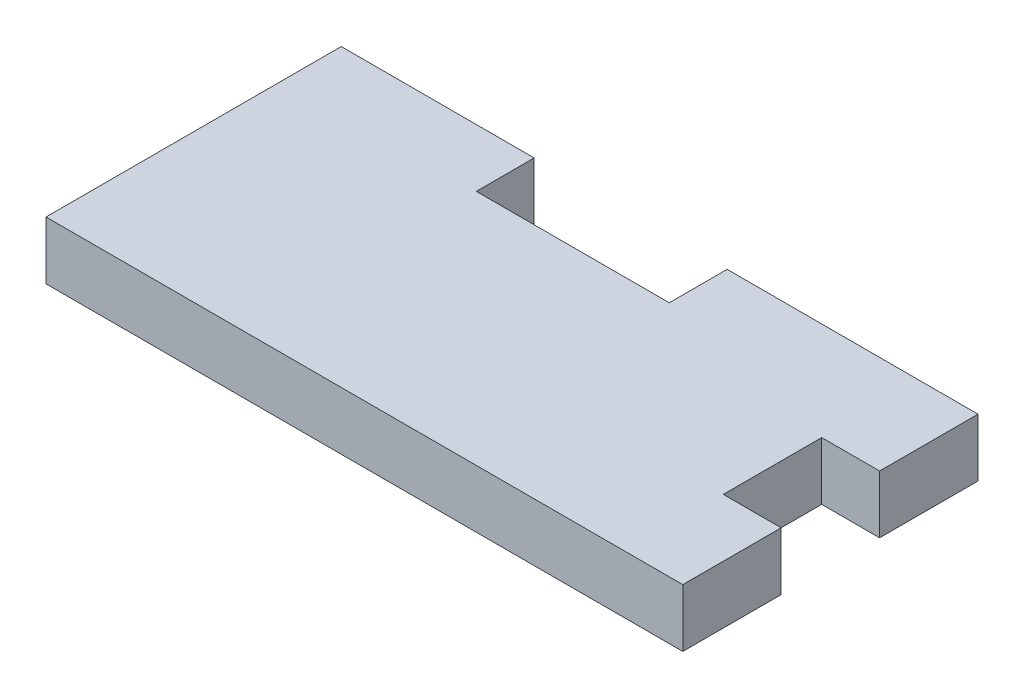
ISO-10303-21;
HEADER;
FILE_DESCRIPTION(('STEP AP214'),'2;1');
FILE_NAME('part.step','',(''),(''),'','','');
FILE_SCHEMA(('AUTOMOTIVE_DESIGN { 1 0 10303 214 1 1 1 1 }'));
ENDSEC;
DATA;
#1=APPLICATION_CONTEXT('core data for automotive mechanical design processes');
#2=APPLICATION_PROTOCOL_DEFINITION('international standard','automotive_design',2000,#1);
#3=PRODUCT_CONTEXT('',#1,'mechanical');
#4=PRODUCT('Part','Part','',(#3));
#5=PRODUCT_RELATED_PRODUCT_CATEGORY('part','',(#4));
#6=PRODUCT_DEFINITION_FORMATION('','',#4);
#7=PRODUCT_DEFINITION_CONTEXT('part definition',#1,'design');
#8=PRODUCT_DEFINITION('design','',#6,#7);
#9=PRODUCT_DEFINITION_SHAPE('','',#8);
#10=(LENGTH_UNIT() NAMED_UNIT(*) SI_UNIT(.MILLI.,.METRE.));
#11=(NAMED_UNIT(*) PLANE_ANGLE_UNIT() SI_UNIT($,.RADIAN.));
#12=(NAMED_UNIT(*) SI_UNIT($,.STERADIAN.) SOLID_ANGLE_UNIT());
#13=UNCERTAINTY_MEASURE_WITH_UNIT(LENGTH_MEASURE(1.E-05),#10,'distance_accuracy_value','');
#14=(GEOMETRIC_REPRESENTATION_CONTEXT(3) GLOBAL_UNCERTAINTY_ASSIGNED_CONTEXT((#13)) GLOBAL_UNIT_ASSIGNED_CONTEXT((#10,
#11,#12)) REPRESENTATION_CONTEXT('',''));
#15=CARTESIAN_POINT('',(0.,0.,0.));
#16=DIRECTION('',(0.,0.,1.));
#17=DIRECTION('',(1.,0.,0.));
#18=AXIS2_PLACEMENT_3D('',#15,#16,#17);
#19=CARTESIAN_POINT('',(0.,3.,0.));
#20=DIRECTION('',(1.,0.,0.));
#21=DIRECTION('',(0.,0.,-1.));
#22=AXIS2_PLACEMENT_3D('',#19,#20,#21);
#23=PLANE('',#22);
#24=DIRECTION('',(0.,0.,1.));
#25=VECTOR('',#24,1.);
#26=CARTESIAN_POINT('',(0.,0.,0.));
#27=LINE('',#26,#25);
#28=CARTESIAN_POINT('',(0.,0.,-15.3));
#29=VERTEX_POINT('',#28);
#30=CARTESIAN_POINT('',(0.,0.,0.));
#31=VERTEX_POINT('',#30);
#32=EDGE_CURVE('E160',#29,#31,#27,.T.);
#33=ORIENTED_EDGE('',*,*,#32,.T.);
#34=DIRECTION('',(0.,-1.,0.));
#35=VECTOR('',#34,1.);
#36=CARTESIAN_POINT('',(0.,3.,0.));
#37=LINE('',#36,#35);
#38=CARTESIAN_POINT('',(0.,3.,0.));
#39=VERTEX_POINT('',#38);
#40=EDGE_CURVE('E11',#39,#31,#37,.T.);
#41=ORIENTED_EDGE('',*,*,#40,.F.);
#42=DIRECTION('',(0.,0.,1.));
#43=VECTOR('',#42,1.);
#44=CARTESIAN_POINT('',(0.,3.,0.));
#45=LINE('',#44,#43);
#46=CARTESIAN_POINT('',(0.,3.,-15.3));
#47=VERTEX_POINT('',#46);
#48=EDGE_CURVE('E183',#47,#39,#45,.T.);
#49=ORIENTED_EDGE('',*,*,#48,.F.);
#50=DIRECTION('',(0.,-1.,0.));
#51=VECTOR('',#50,1.);
#52=CARTESIAN_POINT('',(0.,3.,-15.3));
#53=LINE('',#52,#51);
#54=EDGE_CURVE('E156',#47,#29,#53,.T.);
#55=ORIENTED_EDGE('',*,*,#54,.T.);
#56=EDGE_LOOP('',(#33,#41,#49,#55));
#57=FACE_BOUND('',#56,.T.);
#58=ADVANCED_FACE('F40',(#57),#23,.F.);
#59=CARTESIAN_POINT('',(33.,3.,0.));
#60=DIRECTION('',(0.,0.,-1.));
#61=DIRECTION('',(-1.,0.,0.));
#62=AXIS2_PLACEMENT_3D('',#59,#60,#61);
#63=PLANE('',#62);
#64=DIRECTION('',(1.,0.,0.));
#65=VECTOR('',#64,1.);
#66=CARTESIAN_POINT('',(33.,0.,0.));
#67=LINE('',#66,#65);
#68=CARTESIAN_POINT('',(33.,0.,0.));
#69=VERTEX_POINT('',#68);
#70=EDGE_CURVE('E163',#31,#69,#67,.T.);
#71=ORIENTED_EDGE('',*,*,#70,.T.);
#72=DIRECTION('',(0.,-1.,0.));
#73=VECTOR('',#72,1.);
#74=CARTESIAN_POINT('',(33.,3.,0.));
#75=LINE('',#74,#73);
#76=CARTESIAN_POINT('',(33.,3.,0.));
#77=VERTEX_POINT('',#76);
#78=EDGE_CURVE('E48',#77,#69,#75,.T.);
#79=ORIENTED_EDGE('',*,*,#78,.F.);
#80=DIRECTION('',(1.,0.,0.));
#81=VECTOR('',#80,1.);
#82=CARTESIAN_POINT('',(0.,3.,0.));
#83=LINE('',#82,#81);
#84=EDGE_CURVE('E111',#39,#77,#83,.T.);
#85=ORIENTED_EDGE('',*,*,#84,.F.);
#86=ORIENTED_EDGE('',*,*,#40,.T.);
#87=EDGE_LOOP('',(#71,#79,#85,#86));
#88=FACE_BOUND('',#87,.T.);
#89=ADVANCED_FACE('F260',(#88),#63,.F.);
#90=CARTESIAN_POINT('',(33.,3.,-5.1));
#91=DIRECTION('',(-1.,0.,0.));
#92=DIRECTION('',(0.,0.,1.));
#93=AXIS2_PLACEMENT_3D('',#90,#91,#92);
#94=PLANE('',#93);
#95=DIRECTION('',(0.,0.,-1.));
#96=VECTOR('',#95,1.);
#97=CARTESIAN_POINT('',(33.,0.,-5.1));
#98=LINE('',#97,#96);
#99=CARTESIAN_POINT('',(33.,0.,-5.1));
#100=VERTEX_POINT('',#99);
#101=EDGE_CURVE('E165',#69,#100,#98,.T.);
#102=ORIENTED_EDGE('',*,*,#101,.T.);
#103=DIRECTION('',(0.,-1.,0.));
#104=VECTOR('',#103,1.);
#105=CARTESIAN_POINT('',(33.,3.,-5.1));
#106=LINE('',#105,#104);
#107=CARTESIAN_POINT('',(33.,3.,-5.1));
#108=VERTEX_POINT('',#107);
#109=EDGE_CURVE('E202',#108,#100,#106,.T.);
#110=ORIENTED_EDGE('',*,*,#109,.F.);
#111=DIRECTION('',(0.,0.,-1.));
#112=VECTOR('',#111,1.);
#113=CARTESIAN_POINT('',(33.,3.,-5.1));
#114=LINE('',#113,#112);
#115=EDGE_CURVE('E210',#77,#108,#114,.T.);
#116=ORIENTED_EDGE('',*,*,#115,.F.);
#117=ORIENTED_EDGE('',*,*,#78,.T.);
#118=EDGE_LOOP('',(#102,#110,#116,#117));
#119=FACE_BOUND('',#118,.T.);
#120=ADVANCED_FACE('F208',(#119),#94,.F.);
#121=CARTESIAN_POINT('',(30.,3.,-5.1));
#122=DIRECTION('',(0.,0.,1.));
#123=DIRECTION('',(1.,0.,0.));
#124=AXIS2_PLACEMENT_3D('',#121,#122,#123);
#125=PLANE('',#124);
#126=DIRECTION('',(-1.,0.,0.));
#127=VECTOR('',#126,1.);
#128=CARTESIAN_POINT('',(30.,0.,-5.1));
#129=LINE('',#128,#127);
#130=CARTESIAN_POINT('',(30.,0.,-5.1));
#131=VERTEX_POINT('',#130);
#132=EDGE_CURVE('E167',#100,#131,#129,.T.);
#133=ORIENTED_EDGE('',*,*,#132,.T.);
#134=DIRECTION('',(0.,-1.,0.));
#135=VECTOR('',#134,1.);
#136=CARTESIAN_POINT('',(30.,3.,-5.1));
#137=LINE('',#136,#135);
#138=CARTESIAN_POINT('',(30.,3.,-5.1));
#139=VERTEX_POINT('',#138);
#140=EDGE_CURVE('E199',#139,#131,#137,.T.);
#141=ORIENTED_EDGE('',*,*,#140,.F.);
#142=DIRECTION('',(-1.,0.,0.));
#143=VECTOR('',#142,1.);
#144=CARTESIAN_POINT('',(30.,3.,-5.1));
#145=LINE('',#144,#143);
#146=EDGE_CURVE('E228',#108,#139,#145,.T.);
#147=ORIENTED_EDGE('',*,*,#146,.F.);
#148=ORIENTED_EDGE('',*,*,#109,.T.);
#149=EDGE_LOOP('',(#133,#141,#147,#148));
#150=FACE_BOUND('',#149,.T.);
#151=ADVANCED_FACE('F219',(#150),#125,.F.);
#152=CARTESIAN_POINT('',(30.,3.,-10.2));
#153=DIRECTION('',(-1.,0.,0.));
#154=DIRECTION('',(0.,0.,1.));
#155=AXIS2_PLACEMENT_3D('',#152,#153,#154);
#156=PLANE('',#155);
#157=DIRECTION('',(0.,0.,-1.));
#158=VECTOR('',#157,1.);
#159=CARTESIAN_POINT('',(30.,0.,-10.2));
#160=LINE('',#159,#158);
#161=CARTESIAN_POINT('',(30.,0.,-10.2));
#162=VERTEX_POINT('',#161);
#163=EDGE_CURVE('E169',#131,#162,#160,.T.);
#164=ORIENTED_EDGE('',*,*,#163,.T.);
#165=DIRECTION('',(0.,-1.,0.));
#166=VECTOR('',#165,1.);
#167=CARTESIAN_POINT('',(30.,3.,-10.2));
#168=LINE('',#167,#166);
#169=CARTESIAN_POINT('',(30.,3.,-10.2));
#170=VERTEX_POINT('',#169);
#171=EDGE_CURVE('E196',#170,#162,#168,.T.);
#172=ORIENTED_EDGE('',*,*,#171,.F.);
#173=DIRECTION('',(0.,0.,-1.));
#174=VECTOR('',#173,1.);
#175=CARTESIAN_POINT('',(30.,3.,-10.2));
#176=LINE('',#175,#174);
#177=EDGE_CURVE('E225',#139,#170,#176,.T.);
#178=ORIENTED_EDGE('',*,*,#177,.F.);
#179=ORIENTED_EDGE('',*,*,#140,.T.);
#180=EDGE_LOOP('',(#164,#172,#178,#179));
#181=FACE_BOUND('',#180,.T.);
#182=ADVANCED_FACE('F223',(#181),#156,.F.);
#183=CARTESIAN_POINT('',(33.,3.,-10.2));
#184=DIRECTION('',(0.,0.,-1.));
#185=DIRECTION('',(-1.,0.,0.));
#186=AXIS2_PLACEMENT_3D('',#183,#184,#185);
#187=PLANE('',#186);
#188=DIRECTION('',(1.,0.,0.));
#189=VECTOR('',#188,1.);
#190=CARTESIAN_POINT('',(33.,0.,-10.2));
#191=LINE('',#190,#189);
#192=CARTESIAN_POINT('',(33.,0.,-10.2));
#193=VERTEX_POINT('',#192);
#194=EDGE_CURVE('E171',#162,#193,#191,.T.);
#195=ORIENTED_EDGE('',*,*,#194,.T.);
#196=DIRECTION('',(0.,-1.,0.));
#197=VECTOR('',#196,1.);
#198=CARTESIAN_POINT('',(33.,3.,-10.2));
#199=LINE('',#198,#197);
#200=CARTESIAN_POINT('',(33.,3.,-10.2));
#201=VERTEX_POINT('',#200);
#202=EDGE_CURVE('E193',#201,#193,#199,.T.);
#203=ORIENTED_EDGE('',*,*,#202,.F.);
#204=DIRECTION('',(1.,0.,0.));
#205=VECTOR('',#204,1.);
#206=CARTESIAN_POINT('',(33.,3.,-10.2));
#207=LINE('',#206,#205);
#208=EDGE_CURVE('E227',#170,#201,#207,.T.);
#209=ORIENTED_EDGE('',*,*,#208,.F.);
#210=ORIENTED_EDGE('',*,*,#171,.T.);
#211=EDGE_LOOP('',(#195,#203,#209,#210));
#212=FACE_BOUND('',#211,.T.);
#213=ADVANCED_FACE('F273',(#212),#187,.F.);
#214=CARTESIAN_POINT('',(33.,3.,-15.3));
#215=DIRECTION('',(-1.,0.,0.));
#216=DIRECTION('',(0.,0.,1.));
#217=AXIS2_PLACEMENT_3D('',#214,#215,#216);
#218=PLANE('',#217);
#219=DIRECTION('',(0.,0.,-1.));
#220=VECTOR('',#219,1.);
#221=CARTESIAN_POINT('',(33.,0.,-15.3));
#222=LINE('',#221,#220);
#223=CARTESIAN_POINT('',(33.,0.,-15.3));
#224=VERTEX_POINT('',#223);
#225=EDGE_CURVE('E173',#193,#224,#222,.T.);
#226=ORIENTED_EDGE('',*,*,#225,.T.);
#227=DIRECTION('',(0.,-1.,0.));
#228=VECTOR('',#227,1.);
#229=CARTESIAN_POINT('',(33.,3.,-15.3));
#230=LINE('',#229,#228);
#231=CARTESIAN_POINT('',(33.,3.,-15.3));
#232=VERTEX_POINT('',#231);
#233=EDGE_CURVE('E190',#232,#224,#230,.T.);
#234=ORIENTED_EDGE('',*,*,#233,.F.);
#235=DIRECTION('',(0.,0.,-1.));
#236=VECTOR('',#235,1.);
#237=CARTESIAN_POINT('',(33.,3.,-15.3));
#238=LINE('',#237,#236);
#239=EDGE_CURVE('E230',#201,#232,#238,.T.);
#240=ORIENTED_EDGE('',*,*,#239,.F.);
#241=ORIENTED_EDGE('',*,*,#202,.T.);
#242=EDGE_LOOP('',(#226,#234,#240,#241));
#243=FACE_BOUND('',#242,.T.);
#244=ADVANCED_FACE('F276',(#243),#218,.F.);
#245=CARTESIAN_POINT('',(20.,3.,-15.3));
#246=DIRECTION('',(0.,0.,1.));
#247=DIRECTION('',(1.,0.,0.));
#248=AXIS2_PLACEMENT_3D('',#245,#246,#247);
#249=PLANE('',#248);
#250=DIRECTION('',(-1.,0.,0.));
#251=VECTOR('',#250,1.);
#252=CARTESIAN_POINT('',(20.,0.,-15.3));
#253=LINE('',#252,#251);
#254=CARTESIAN_POINT('',(20.,0.,-15.3));
#255=VERTEX_POINT('',#254);
#256=EDGE_CURVE('E176',#224,#255,#253,.T.);
#257=ORIENTED_EDGE('',*,*,#256,.T.);
#258=DIRECTION('',(0.,-1.,0.));
#259=VECTOR('',#258,1.);
#260=CARTESIAN_POINT('',(20.,3.,-15.3));
#261=LINE('',#260,#259);
#262=CARTESIAN_POINT('',(20.,3.,-15.3));
#263=VERTEX_POINT('',#262);
#264=EDGE_CURVE('E187',#263,#255,#261,.T.);
#265=ORIENTED_EDGE('',*,*,#264,.F.);
#266=DIRECTION('',(-1.,0.,0.));
#267=VECTOR('',#266,1.);
#268=CARTESIAN_POINT('',(30.,3.,-15.3));
#269=LINE('',#268,#267);
#270=EDGE_CURVE('E236',#232,#263,#269,.T.);
#271=ORIENTED_EDGE('',*,*,#270,.F.);
#272=ORIENTED_EDGE('',*,*,#233,.T.);
#273=EDGE_LOOP('',(#257,#265,#271,#272));
#274=FACE_BOUND('',#273,.T.);
#275=ADVANCED_FACE('F242',(#274),#249,.F.);
#276=CARTESIAN_POINT('',(20.,3.,-12.3));
#277=DIRECTION('',(1.,0.,0.));
#278=DIRECTION('',(0.,0.,-1.));
#279=AXIS2_PLACEMENT_3D('',#276,#277,#278);
#280=PLANE('',#279);
#281=DIRECTION('',(0.,0.,1.));
#282=VECTOR('',#281,1.);
#283=CARTESIAN_POINT('',(20.,0.,-12.3));
#284=LINE('',#283,#282);
#285=CARTESIAN_POINT('',(20.,0.,-12.3));
#286=VERTEX_POINT('',#285);
#287=EDGE_CURVE('E178',#255,#286,#284,.T.);
#288=ORIENTED_EDGE('',*,*,#287,.T.);
#289=DIRECTION('',(0.,-1.,0.));
#290=VECTOR('',#289,1.);
#291=CARTESIAN_POINT('',(20.,3.,-12.3));
#292=LINE('',#291,#290);
#293=CARTESIAN_POINT('',(20.,3.,-12.3));
#294=VERTEX_POINT('',#293);
#295=EDGE_CURVE('E151',#294,#286,#292,.T.);
#296=ORIENTED_EDGE('',*,*,#295,.F.);
#297=DIRECTION('',(0.,0.,1.));
#298=VECTOR('',#297,1.);
#299=CARTESIAN_POINT('',(20.,3.,-12.3));
#300=LINE('',#299,#298);
#301=EDGE_CURVE('E142',#263,#294,#300,.T.);
#302=ORIENTED_EDGE('',*,*,#301,.F.);
#303=ORIENTED_EDGE('',*,*,#264,.T.);
#304=EDGE_LOOP('',(#288,#296,#302,#303));
#305=FACE_BOUND('',#304,.T.);
#306=ADVANCED_FACE('F245',(#305),#280,.F.);
#307=CARTESIAN_POINT('',(10.,3.,-12.3));
#308=DIRECTION('',(0.,0.,1.));
#309=DIRECTION('',(1.,0.,0.));
#310=AXIS2_PLACEMENT_3D('',#307,#308,#309);
#311=PLANE('',#310);
#312=DIRECTION('',(-1.,0.,0.));
#313=VECTOR('',#312,1.);
#314=CARTESIAN_POINT('',(10.,0.,-12.3));
#315=LINE('',#314,#313);
#316=CARTESIAN_POINT('',(10.,0.,-12.3));
#317=VERTEX_POINT('',#316);
#318=EDGE_CURVE('E150',#286,#317,#315,.T.);
#319=ORIENTED_EDGE('',*,*,#318,.T.);
#320=DIRECTION('',(0.,-1.,0.));
#321=VECTOR('',#320,1.);
#322=CARTESIAN_POINT('',(10.,3.,-12.3));
#323=LINE('',#322,#321);
#324=CARTESIAN_POINT('',(10.,3.,-12.3));
#325=VERTEX_POINT('',#324);
#326=EDGE_CURVE('E147',#325,#317,#323,.T.);
#327=ORIENTED_EDGE('',*,*,#326,.F.);
#328=DIRECTION('',(-1.,0.,0.));
#329=VECTOR('',#328,1.);
#330=CARTESIAN_POINT('',(10.,3.,-12.3));
#331=LINE('',#330,#329);
#332=EDGE_CURVE('E136',#294,#325,#331,.T.);
#333=ORIENTED_EDGE('',*,*,#332,.F.);
#334=ORIENTED_EDGE('',*,*,#295,.T.);
#335=EDGE_LOOP('',(#319,#327,#333,#334));
#336=FACE_BOUND('',#335,.T.);
#337=ADVANCED_FACE('F148',(#336),#311,.F.);
#338=CARTESIAN_POINT('',(10.,3.,-15.3));
#339=DIRECTION('',(-1.,0.,0.));
#340=DIRECTION('',(0.,0.,1.));
#341=AXIS2_PLACEMENT_3D('',#338,#339,#340);
#342=PLANE('',#341);
#343=DIRECTION('',(0.,0.,-1.));
#344=VECTOR('',#343,1.);
#345=CARTESIAN_POINT('',(10.,0.,-15.3));
#346=LINE('',#345,#344);
#347=CARTESIAN_POINT('',(10.,0.,-15.3));
#348=VERTEX_POINT('',#347);
#349=EDGE_CURVE('E97',#317,#348,#346,.T.);
#350=ORIENTED_EDGE('',*,*,#349,.T.);
#351=DIRECTION('',(0.,-1.,0.));
#352=VECTOR('',#351,1.);
#353=CARTESIAN_POINT('',(10.,3.,-15.3));
#354=LINE('',#353,#352);
#355=CARTESIAN_POINT('',(10.,3.,-15.3));
#356=VERTEX_POINT('',#355);
#357=EDGE_CURVE('E152',#356,#348,#354,.T.);
#358=ORIENTED_EDGE('',*,*,#357,.F.);
#359=DIRECTION('',(0.,0.,-1.));
#360=VECTOR('',#359,1.);
#361=CARTESIAN_POINT('',(10.,3.,-15.3));
#362=LINE('',#361,#360);
#363=EDGE_CURVE('E140',#325,#356,#362,.T.);
#364=ORIENTED_EDGE('',*,*,#363,.F.);
#365=ORIENTED_EDGE('',*,*,#326,.T.);
#366=EDGE_LOOP('',(#350,#358,#364,#365));
#367=FACE_BOUND('',#366,.T.);
#368=ADVANCED_FACE('F154',(#367),#342,.F.);
#369=CARTESIAN_POINT('',(0.,3.,-15.3));
#370=DIRECTION('',(0.,0.,1.));
#371=DIRECTION('',(1.,0.,0.));
#372=AXIS2_PLACEMENT_3D('',#369,#370,#371);
#373=PLANE('',#372);
#374=DIRECTION('',(-1.,0.,0.));
#375=VECTOR('',#374,1.);
#376=CARTESIAN_POINT('',(0.,0.,-15.3));
#377=LINE('',#376,#375);
#378=EDGE_CURVE('E103',#348,#29,#377,.T.);
#379=ORIENTED_EDGE('',*,*,#378,.T.);
#380=ORIENTED_EDGE('',*,*,#54,.F.);
#381=DIRECTION('',(-1.,0.,0.));
#382=VECTOR('',#381,1.);
#383=CARTESIAN_POINT('',(0.,3.,-15.3));
#384=LINE('',#383,#382);
#385=EDGE_CURVE('E56',#356,#47,#384,.T.);
#386=ORIENTED_EDGE('',*,*,#385,.F.);
#387=ORIENTED_EDGE('',*,*,#357,.T.);
#388=EDGE_LOOP('',(#379,#380,#386,#387));
#389=FACE_BOUND('',#388,.T.);
#390=ADVANCED_FACE('F249',(#389),#373,.F.);
#391=CARTESIAN_POINT('',(0.,3.,0.));
#392=DIRECTION('',(0.,-1.,0.));
#393=DIRECTION('',(0.,0.,-1.));
#394=AXIS2_PLACEMENT_3D('',#391,#392,#393);
#395=PLANE('',#394);
#396=ORIENTED_EDGE('',*,*,#48,.T.);
#397=ORIENTED_EDGE('',*,*,#84,.T.);
#398=ORIENTED_EDGE('',*,*,#115,.T.);
#399=ORIENTED_EDGE('',*,*,#146,.T.);
#400=ORIENTED_EDGE('',*,*,#177,.T.);
#401=ORIENTED_EDGE('',*,*,#208,.T.);
#402=ORIENTED_EDGE('',*,*,#239,.T.);
#403=ORIENTED_EDGE('',*,*,#270,.T.);
#404=ORIENTED_EDGE('',*,*,#301,.T.);
#405=ORIENTED_EDGE('',*,*,#332,.T.);
#406=ORIENTED_EDGE('',*,*,#363,.T.);
#407=ORIENTED_EDGE('',*,*,#385,.T.);
#408=EDGE_LOOP('',(#396,#397,#398,#399,#400,#401,#402,#403,#404,#405,#406,#407));
#409=FACE_BOUND('',#408,.T.);
#410=ADVANCED_FACE('F138',(#409),#395,.F.);
#411=CARTESIAN_POINT('',(0.,0.,0.));
#412=DIRECTION('',(0.,-1.,0.));
#413=DIRECTION('',(0.,0.,-1.));
#414=AXIS2_PLACEMENT_3D('',#411,#412,#413);
#415=PLANE('',#414);
#416=ORIENTED_EDGE('',*,*,#32,.F.);
#417=ORIENTED_EDGE('',*,*,#378,.F.);
#418=ORIENTED_EDGE('',*,*,#349,.F.);
#419=ORIENTED_EDGE('',*,*,#318,.F.);
#420=ORIENTED_EDGE('',*,*,#287,.F.);
#421=ORIENTED_EDGE('',*,*,#256,.F.);
#422=ORIENTED_EDGE('',*,*,#225,.F.);
#423=ORIENTED_EDGE('',*,*,#194,.F.);
#424=ORIENTED_EDGE('',*,*,#163,.F.);
#425=ORIENTED_EDGE('',*,*,#132,.F.);
#426=ORIENTED_EDGE('',*,*,#101,.F.);
#427=ORIENTED_EDGE('',*,*,#70,.F.);
#428=EDGE_LOOP('',(#416,#417,#418,#419,#420,#421,#422,#423,#424,#425,#426,#427));
#429=FACE_BOUND('',#428,.T.);
#430=ADVANCED_FACE('F214',(#429),#415,.T.);
#431=CLOSED_SHELL('',(#58,#89,#120,#151,#182,#213,#244,#275,#306,#337,#368,#390,#410,#430));
#432=MANIFOLD_SOLID_BREP('B2',#431);
#433=ADVANCED_BREP_SHAPE_REPRESENTATION('',(#18,#432),#14);
#434=SHAPE_DEFINITION_REPRESENTATION(#9,#433);
ENDSEC;
END-ISO-10303-21;
